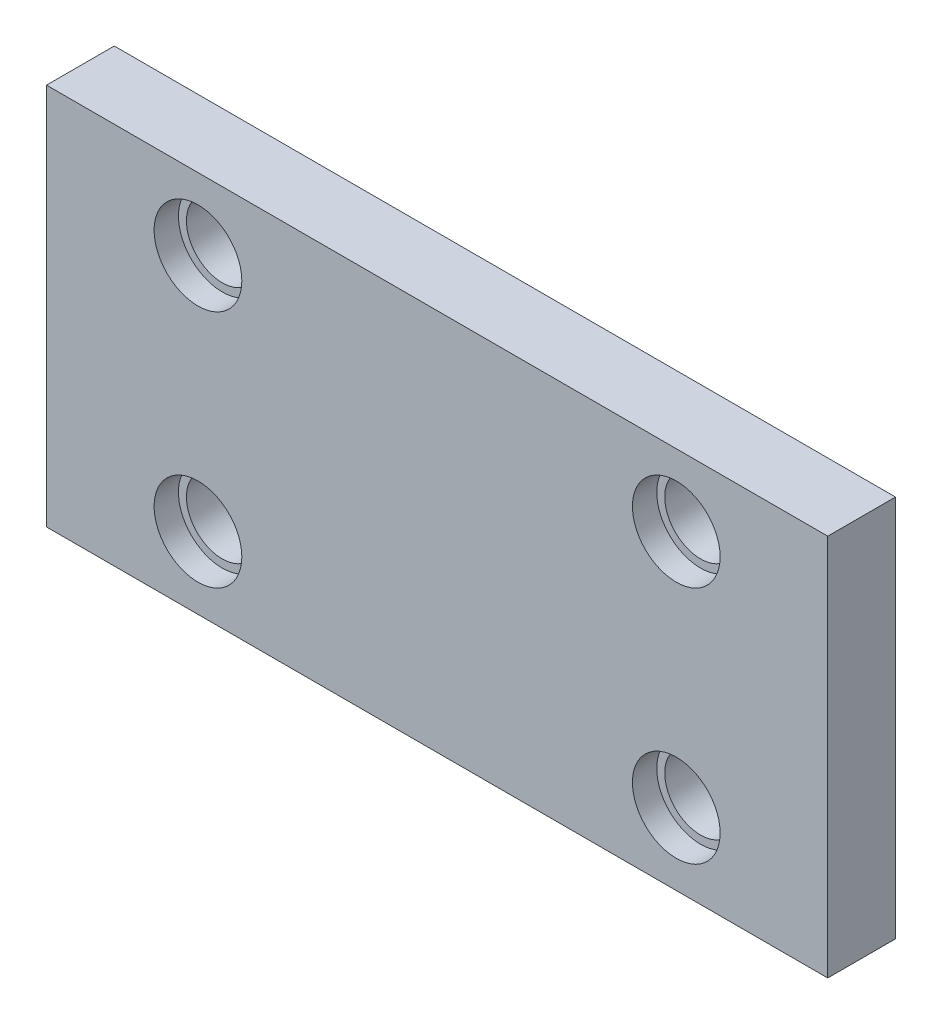
ISO-10303-21;
HEADER;
FILE_DESCRIPTION(('STEP AP214'),'2;1');
FILE_NAME('part.step','',(''),(''),'','','');
FILE_SCHEMA(('AUTOMOTIVE_DESIGN { 1 0 10303 214 1 1 1 1 }'));
ENDSEC;
DATA;
#1=APPLICATION_CONTEXT('core data for automotive mechanical design processes');
#2=APPLICATION_PROTOCOL_DEFINITION('international standard','automotive_design',2000,#1);
#3=PRODUCT_CONTEXT('',#1,'mechanical');
#4=PRODUCT('Part','Part','',(#3));
#5=PRODUCT_RELATED_PRODUCT_CATEGORY('part','',(#4));
#6=PRODUCT_DEFINITION_FORMATION('','',#4);
#7=PRODUCT_DEFINITION_CONTEXT('part definition',#1,'design');
#8=PRODUCT_DEFINITION('design','',#6,#7);
#9=PRODUCT_DEFINITION_SHAPE('','',#8);
#10=(LENGTH_UNIT() NAMED_UNIT(*) SI_UNIT(.MILLI.,.METRE.));
#11=(NAMED_UNIT(*) PLANE_ANGLE_UNIT() SI_UNIT($,.RADIAN.));
#12=(NAMED_UNIT(*) SI_UNIT($,.STERADIAN.) SOLID_ANGLE_UNIT());
#13=UNCERTAINTY_MEASURE_WITH_UNIT(LENGTH_MEASURE(1.E-05),#10,'distance_accuracy_value','');
#14=(GEOMETRIC_REPRESENTATION_CONTEXT(3) GLOBAL_UNCERTAINTY_ASSIGNED_CONTEXT((#13)) GLOBAL_UNIT_ASSIGNED_CONTEXT((#10,
#11,#12)) REPRESENTATION_CONTEXT('',''));
#15=CARTESIAN_POINT('',(0.,0.,0.));
#16=DIRECTION('',(0.,0.,1.));
#17=DIRECTION('',(1.,0.,0.));
#18=AXIS2_PLACEMENT_3D('',#15,#16,#17);
#19=CARTESIAN_POINT('',(-98.,-48.,-17.));
#20=DIRECTION('',(-1.,0.,0.));
#21=DIRECTION('',(0.,-1.,0.));
#22=AXIS2_PLACEMENT_3D('',#19,#20,#21);
#23=PLANE('',#22);
#24=DIRECTION('',(0.,-1.,0.));
#25=VECTOR('',#24,1.);
#26=CARTESIAN_POINT('',(-98.,-48.,0.));
#27=LINE('',#26,#25);
#28=CARTESIAN_POINT('',(-98.,48.,0.));
#29=VERTEX_POINT('',#28);
#30=CARTESIAN_POINT('',(-98.,-48.,0.));
#31=VERTEX_POINT('',#30);
#32=EDGE_CURVE('E100',#29,#31,#27,.T.);
#33=ORIENTED_EDGE('',*,*,#32,.F.);
#34=DIRECTION('',(0.,0.,1.));
#35=VECTOR('',#34,1.);
#36=CARTESIAN_POINT('',(-98.,48.,-17.));
#37=LINE('',#36,#35);
#38=CARTESIAN_POINT('',(-98.,48.,-17.));
#39=VERTEX_POINT('',#38);
#40=EDGE_CURVE('E11',#39,#29,#37,.T.);
#41=ORIENTED_EDGE('',*,*,#40,.F.);
#42=DIRECTION('',(0.,-1.,0.));
#43=VECTOR('',#42,1.);
#44=CARTESIAN_POINT('',(-98.,-48.,-17.));
#45=LINE('',#44,#43);
#46=CARTESIAN_POINT('',(-98.,-48.,-17.));
#47=VERTEX_POINT('',#46);
#48=EDGE_CURVE('E93',#39,#47,#45,.T.);
#49=ORIENTED_EDGE('',*,*,#48,.T.);
#50=DIRECTION('',(0.,0.,1.));
#51=VECTOR('',#50,1.);
#52=CARTESIAN_POINT('',(-98.,-48.,-17.));
#53=LINE('',#52,#51);
#54=EDGE_CURVE('E38',#47,#31,#53,.T.);
#55=ORIENTED_EDGE('',*,*,#54,.T.);
#56=EDGE_LOOP('',(#33,#41,#49,#55));
#57=FACE_BOUND('',#56,.T.);
#58=ADVANCED_FACE('F35',(#57),#23,.T.);
#59=CARTESIAN_POINT('',(97.9999999999999,48.,-17.));
#60=DIRECTION('',(0.,1.,0.));
#61=DIRECTION('',(-1.,0.,0.));
#62=AXIS2_PLACEMENT_3D('',#59,#60,#61);
#63=PLANE('',#62);
#64=DIRECTION('',(-1.,0.,0.));
#65=VECTOR('',#64,1.);
#66=CARTESIAN_POINT('',(97.9999999999999,48.,0.));
#67=LINE('',#66,#65);
#68=CARTESIAN_POINT('',(97.9999999999999,48.,0.));
#69=VERTEX_POINT('',#68);
#70=EDGE_CURVE('E95',#69,#29,#67,.T.);
#71=ORIENTED_EDGE('',*,*,#70,.F.);
#72=DIRECTION('',(0.,0.,1.));
#73=VECTOR('',#72,1.);
#74=CARTESIAN_POINT('',(97.9999999999999,48.,-17.));
#75=LINE('',#74,#73);
#76=CARTESIAN_POINT('',(97.9999999999999,48.,-17.));
#77=VERTEX_POINT('',#76);
#78=EDGE_CURVE('E44',#77,#69,#75,.T.);
#79=ORIENTED_EDGE('',*,*,#78,.F.);
#80=DIRECTION('',(-1.,0.,0.));
#81=VECTOR('',#80,1.);
#82=CARTESIAN_POINT('',(97.9999999999999,48.,-17.));
#83=LINE('',#82,#81);
#84=EDGE_CURVE('E90',#77,#39,#83,.T.);
#85=ORIENTED_EDGE('',*,*,#84,.T.);
#86=ORIENTED_EDGE('',*,*,#40,.T.);
#87=EDGE_LOOP('',(#71,#79,#85,#86));
#88=FACE_BOUND('',#87,.T.);
#89=ADVANCED_FACE('F111',(#88),#63,.T.);
#90=CARTESIAN_POINT('',(97.9999999999999,-48.,-17.));
#91=DIRECTION('',(1.,0.,0.));
#92=DIRECTION('',(0.,0.,-1.));
#93=AXIS2_PLACEMENT_3D('',#90,#91,#92);
#94=PLANE('',#93);
#95=DIRECTION('',(0.,1.,0.));
#96=VECTOR('',#95,1.);
#97=CARTESIAN_POINT('',(97.9999999999999,-48.,0.));
#98=LINE('',#97,#96);
#99=CARTESIAN_POINT('',(97.9999999999999,-48.,0.));
#100=VERTEX_POINT('',#99);
#101=EDGE_CURVE('E85',#100,#69,#98,.T.);
#102=ORIENTED_EDGE('',*,*,#101,.F.);
#103=DIRECTION('',(0.,0.,1.));
#104=VECTOR('',#103,1.);
#105=CARTESIAN_POINT('',(97.9999999999999,-48.,-17.));
#106=LINE('',#105,#104);
#107=CARTESIAN_POINT('',(97.9999999999999,-48.,-17.));
#108=VERTEX_POINT('',#107);
#109=EDGE_CURVE('E80',#108,#100,#106,.T.);
#110=ORIENTED_EDGE('',*,*,#109,.F.);
#111=DIRECTION('',(0.,1.,0.));
#112=VECTOR('',#111,1.);
#113=CARTESIAN_POINT('',(97.9999999999999,-48.,-17.));
#114=LINE('',#113,#112);
#115=EDGE_CURVE('E83',#108,#77,#114,.T.);
#116=ORIENTED_EDGE('',*,*,#115,.T.);
#117=ORIENTED_EDGE('',*,*,#78,.T.);
#118=EDGE_LOOP('',(#102,#110,#116,#117));
#119=FACE_BOUND('',#118,.T.);
#120=ADVANCED_FACE('F82',(#119),#94,.T.);
#121=CARTESIAN_POINT('',(97.9999999999999,-48.,-17.));
#122=DIRECTION('',(0.,-1.,0.));
#123=DIRECTION('',(1.,0.,0.));
#124=AXIS2_PLACEMENT_3D('',#121,#122,#123);
#125=PLANE('',#124);
#126=DIRECTION('',(1.,0.,0.));
#127=VECTOR('',#126,1.);
#128=CARTESIAN_POINT('',(97.9999999999999,-48.,0.));
#129=LINE('',#128,#127);
#130=EDGE_CURVE('E103',#31,#100,#129,.T.);
#131=ORIENTED_EDGE('',*,*,#130,.F.);
#132=ORIENTED_EDGE('',*,*,#54,.F.);
#133=DIRECTION('',(1.,0.,0.));
#134=VECTOR('',#133,1.);
#135=CARTESIAN_POINT('',(97.9999999999999,-48.,-17.));
#136=LINE('',#135,#134);
#137=EDGE_CURVE('E89',#47,#108,#136,.T.);
#138=ORIENTED_EDGE('',*,*,#137,.T.);
#139=ORIENTED_EDGE('',*,*,#109,.T.);
#140=EDGE_LOOP('',(#131,#132,#138,#139));
#141=FACE_BOUND('',#140,.T.);
#142=ADVANCED_FACE('F92',(#141),#125,.T.);
#143=CARTESIAN_POINT('',(-98.0000000000001,48.,-17.));
#144=DIRECTION('',(0.,0.,1.));
#145=DIRECTION('',(1.,0.,0.));
#146=AXIS2_PLACEMENT_3D('',#143,#144,#145);
#147=PLANE('',#146);
#148=CARTESIAN_POINT('',(60.,30.,-17.));
#149=DIRECTION('',(0.,0.,1.));
#150=DIRECTION('',(1.,0.,0.));
#151=AXIS2_PLACEMENT_3D('',#148,#149,#150);
#152=CIRCLE('',#151,8.99999999999999);
#153=CARTESIAN_POINT('',(69.,30.,-17.));
#154=VERTEX_POINT('',#153);
#155=EDGE_CURVE('E195',#154,#154,#152,.T.);
#156=ORIENTED_EDGE('',*,*,#155,.T.);
#157=EDGE_LOOP('',(#156));
#158=FACE_BOUND('',#157,.T.);
#159=CARTESIAN_POINT('',(-60.,30.,-17.));
#160=DIRECTION('',(0.,0.,1.));
#161=DIRECTION('',(1.,0.,0.));
#162=AXIS2_PLACEMENT_3D('',#159,#160,#161);
#163=CIRCLE('',#162,8.99999999999999);
#164=CARTESIAN_POINT('',(-51.,30.,-17.));
#165=VERTEX_POINT('',#164);
#166=EDGE_CURVE('E206',#165,#165,#163,.T.);
#167=ORIENTED_EDGE('',*,*,#166,.T.);
#168=EDGE_LOOP('',(#167));
#169=FACE_BOUND('',#168,.T.);
#170=CARTESIAN_POINT('',(-60.,-30.,-17.));
#171=DIRECTION('',(0.,0.,1.));
#172=DIRECTION('',(1.,0.,0.));
#173=AXIS2_PLACEMENT_3D('',#170,#171,#172);
#174=CIRCLE('',#173,8.99999999999999);
#175=CARTESIAN_POINT('',(-51.,-30.,-17.));
#176=VERTEX_POINT('',#175);
#177=EDGE_CURVE('E218',#176,#176,#174,.T.);
#178=ORIENTED_EDGE('',*,*,#177,.T.);
#179=EDGE_LOOP('',(#178));
#180=FACE_BOUND('',#179,.T.);
#181=CARTESIAN_POINT('',(60.,-30.,-17.));
#182=DIRECTION('',(0.,0.,1.));
#183=DIRECTION('',(1.,0.,0.));
#184=AXIS2_PLACEMENT_3D('',#181,#182,#183);
#185=CIRCLE('',#184,8.99999999999999);
#186=CARTESIAN_POINT('',(69.,-30.,-17.));
#187=VERTEX_POINT('',#186);
#188=EDGE_CURVE('E104',#187,#187,#185,.T.);
#189=ORIENTED_EDGE('',*,*,#188,.T.);
#190=EDGE_LOOP('',(#189));
#191=FACE_BOUND('',#190,.T.);
#192=ORIENTED_EDGE('',*,*,#48,.F.);
#193=ORIENTED_EDGE('',*,*,#84,.F.);
#194=ORIENTED_EDGE('',*,*,#115,.F.);
#195=ORIENTED_EDGE('',*,*,#137,.F.);
#196=EDGE_LOOP('',(#192,#193,#194,#195));
#197=FACE_BOUND('',#196,.T.);
#198=ADVANCED_FACE('F88',(#158,#169,#180,#191,#197),#147,.F.);
#199=CARTESIAN_POINT('',(-98.0000000000001,48.,0.));
#200=DIRECTION('',(0.,0.,1.));
#201=DIRECTION('',(1.,0.,0.));
#202=AXIS2_PLACEMENT_3D('',#199,#200,#201);
#203=PLANE('',#202);
#204=CARTESIAN_POINT('',(60.,30.,0.));
#205=DIRECTION('',(0.,0.,1.));
#206=DIRECTION('',(1.,0.,0.));
#207=AXIS2_PLACEMENT_3D('',#204,#205,#206);
#208=CIRCLE('',#207,11.);
#209=CARTESIAN_POINT('',(71.,30.,0.));
#210=VERTEX_POINT('',#209);
#211=EDGE_CURVE('E188',#210,#210,#208,.T.);
#212=ORIENTED_EDGE('',*,*,#211,.F.);
#213=EDGE_LOOP('',(#212));
#214=FACE_BOUND('',#213,.T.);
#215=CARTESIAN_POINT('',(-60.,30.,0.));
#216=DIRECTION('',(0.,0.,1.));
#217=DIRECTION('',(1.,0.,0.));
#218=AXIS2_PLACEMENT_3D('',#215,#216,#217);
#219=CIRCLE('',#218,11.);
#220=CARTESIAN_POINT('',(-49.,30.,0.));
#221=VERTEX_POINT('',#220);
#222=EDGE_CURVE('E197',#221,#221,#219,.T.);
#223=ORIENTED_EDGE('',*,*,#222,.F.);
#224=EDGE_LOOP('',(#223));
#225=FACE_BOUND('',#224,.T.);
#226=CARTESIAN_POINT('',(-60.,-30.,0.));
#227=DIRECTION('',(0.,0.,1.));
#228=DIRECTION('',(1.,0.,0.));
#229=AXIS2_PLACEMENT_3D('',#226,#227,#228);
#230=CIRCLE('',#229,11.);
#231=CARTESIAN_POINT('',(-49.,-30.,0.));
#232=VERTEX_POINT('',#231);
#233=EDGE_CURVE('E209',#232,#232,#230,.T.);
#234=ORIENTED_EDGE('',*,*,#233,.F.);
#235=EDGE_LOOP('',(#234));
#236=FACE_BOUND('',#235,.T.);
#237=CARTESIAN_POINT('',(60.,-30.,0.));
#238=DIRECTION('',(0.,0.,1.));
#239=DIRECTION('',(1.,0.,0.));
#240=AXIS2_PLACEMENT_3D('',#237,#238,#239);
#241=CIRCLE('',#240,11.);
#242=CARTESIAN_POINT('',(71.,-30.,0.));
#243=VERTEX_POINT('',#242);
#244=EDGE_CURVE('E221',#243,#243,#241,.T.);
#245=ORIENTED_EDGE('',*,*,#244,.F.);
#246=EDGE_LOOP('',(#245));
#247=FACE_BOUND('',#246,.T.);
#248=ORIENTED_EDGE('',*,*,#32,.T.);
#249=ORIENTED_EDGE('',*,*,#130,.T.);
#250=ORIENTED_EDGE('',*,*,#101,.T.);
#251=ORIENTED_EDGE('',*,*,#70,.T.);
#252=EDGE_LOOP('',(#248,#249,#250,#251));
#253=FACE_BOUND('',#252,.T.);
#254=ADVANCED_FACE('F110',(#214,#225,#236,#247,#253),#203,.T.);
#255=CARTESIAN_POINT('',(60.,-30.,0.));
#256=DIRECTION('',(0.,0.,1.));
#257=DIRECTION('',(1.,0.,0.));
#258=AXIS2_PLACEMENT_3D('',#255,#256,#257);
#259=CYLINDRICAL_SURFACE('',#258,8.99999999999999);
#260=ORIENTED_EDGE('',*,*,#188,.F.);
#261=EDGE_LOOP('',(#260));
#262=FACE_BOUND('',#261,.T.);
#263=CARTESIAN_POINT('',(60.,-30.,-6.1));
#264=DIRECTION('',(0.,0.,1.));
#265=DIRECTION('',(1.,0.,0.));
#266=AXIS2_PLACEMENT_3D('',#263,#264,#265);
#267=CIRCLE('',#266,8.99999999999999);
#268=CARTESIAN_POINT('',(69.,-30.,-6.1));
#269=VERTEX_POINT('',#268);
#270=EDGE_CURVE('E227',#269,#269,#267,.T.);
#271=ORIENTED_EDGE('',*,*,#270,.T.);
#272=EDGE_LOOP('',(#271));
#273=FACE_BOUND('',#272,.T.);
#274=ADVANCED_FACE('F129',(#262,#273),#259,.F.);
#275=CARTESIAN_POINT('',(69.,-30.,-6.1));
#276=DIRECTION('',(0.,0.,-1.));
#277=DIRECTION('',(-1.,0.,0.));
#278=AXIS2_PLACEMENT_3D('',#275,#276,#277);
#279=PLANE('',#278);
#280=ORIENTED_EDGE('',*,*,#270,.F.);
#281=EDGE_LOOP('',(#280));
#282=FACE_BOUND('',#281,.T.);
#283=CARTESIAN_POINT('',(60.,-30.,-6.1));
#284=DIRECTION('',(0.,0.,1.));
#285=DIRECTION('',(1.,0.,0.));
#286=AXIS2_PLACEMENT_3D('',#283,#284,#285);
#287=CIRCLE('',#286,11.);
#288=CARTESIAN_POINT('',(71.,-30.,-6.1));
#289=VERTEX_POINT('',#288);
#290=EDGE_CURVE('E224',#289,#289,#287,.T.);
#291=ORIENTED_EDGE('',*,*,#290,.T.);
#292=EDGE_LOOP('',(#291));
#293=FACE_BOUND('',#292,.T.);
#294=ADVANCED_FACE('F136',(#282,#293),#279,.F.);
#295=CARTESIAN_POINT('',(60.,-30.,0.));
#296=DIRECTION('',(0.,0.,1.));
#297=DIRECTION('',(1.,0.,0.));
#298=AXIS2_PLACEMENT_3D('',#295,#296,#297);
#299=CYLINDRICAL_SURFACE('',#298,11.);
#300=ORIENTED_EDGE('',*,*,#290,.F.);
#301=EDGE_LOOP('',(#300));
#302=FACE_BOUND('',#301,.T.);
#303=ORIENTED_EDGE('',*,*,#244,.T.);
#304=EDGE_LOOP('',(#303));
#305=FACE_BOUND('',#304,.T.);
#306=ADVANCED_FACE('F140',(#302,#305),#299,.F.);
#307=CARTESIAN_POINT('',(-60.,-30.,0.));
#308=DIRECTION('',(0.,0.,1.));
#309=DIRECTION('',(1.,0.,0.));
#310=AXIS2_PLACEMENT_3D('',#307,#308,#309);
#311=CYLINDRICAL_SURFACE('',#310,8.99999999999999);
#312=ORIENTED_EDGE('',*,*,#177,.F.);
#313=EDGE_LOOP('',(#312));
#314=FACE_BOUND('',#313,.T.);
#315=CARTESIAN_POINT('',(-60.,-30.,-6.1));
#316=DIRECTION('',(0.,0.,1.));
#317=DIRECTION('',(1.,0.,0.));
#318=AXIS2_PLACEMENT_3D('',#315,#316,#317);
#319=CIRCLE('',#318,8.99999999999999);
#320=CARTESIAN_POINT('',(-51.,-30.,-6.1));
#321=VERTEX_POINT('',#320);
#322=EDGE_CURVE('E215',#321,#321,#319,.T.);
#323=ORIENTED_EDGE('',*,*,#322,.T.);
#324=EDGE_LOOP('',(#323));
#325=FACE_BOUND('',#324,.T.);
#326=ADVANCED_FACE('F144',(#314,#325),#311,.F.);
#327=CARTESIAN_POINT('',(-51.,-30.,-6.1));
#328=DIRECTION('',(0.,0.,-1.));
#329=DIRECTION('',(-1.,0.,0.));
#330=AXIS2_PLACEMENT_3D('',#327,#328,#329);
#331=PLANE('',#330);
#332=ORIENTED_EDGE('',*,*,#322,.F.);
#333=EDGE_LOOP('',(#332));
#334=FACE_BOUND('',#333,.T.);
#335=CARTESIAN_POINT('',(-60.,-30.,-6.1));
#336=DIRECTION('',(0.,0.,1.));
#337=DIRECTION('',(1.,0.,0.));
#338=AXIS2_PLACEMENT_3D('',#335,#336,#337);
#339=CIRCLE('',#338,11.);
#340=CARTESIAN_POINT('',(-49.,-30.,-6.1));
#341=VERTEX_POINT('',#340);
#342=EDGE_CURVE('E212',#341,#341,#339,.T.);
#343=ORIENTED_EDGE('',*,*,#342,.T.);
#344=EDGE_LOOP('',(#343));
#345=FACE_BOUND('',#344,.T.);
#346=ADVANCED_FACE('F148',(#334,#345),#331,.F.);
#347=CARTESIAN_POINT('',(-60.,-30.,0.));
#348=DIRECTION('',(0.,0.,1.));
#349=DIRECTION('',(1.,0.,0.));
#350=AXIS2_PLACEMENT_3D('',#347,#348,#349);
#351=CYLINDRICAL_SURFACE('',#350,11.);
#352=ORIENTED_EDGE('',*,*,#342,.F.);
#353=EDGE_LOOP('',(#352));
#354=FACE_BOUND('',#353,.T.);
#355=ORIENTED_EDGE('',*,*,#233,.T.);
#356=EDGE_LOOP('',(#355));
#357=FACE_BOUND('',#356,.T.);
#358=ADVANCED_FACE('F152',(#354,#357),#351,.F.);
#359=CARTESIAN_POINT('',(-60.,30.,0.));
#360=DIRECTION('',(0.,0.,1.));
#361=DIRECTION('',(1.,0.,0.));
#362=AXIS2_PLACEMENT_3D('',#359,#360,#361);
#363=CYLINDRICAL_SURFACE('',#362,8.99999999999999);
#364=ORIENTED_EDGE('',*,*,#166,.F.);
#365=EDGE_LOOP('',(#364));
#366=FACE_BOUND('',#365,.T.);
#367=CARTESIAN_POINT('',(-60.,30.,-6.1));
#368=DIRECTION('',(0.,0.,1.));
#369=DIRECTION('',(1.,0.,0.));
#370=AXIS2_PLACEMENT_3D('',#367,#368,#369);
#371=CIRCLE('',#370,8.99999999999999);
#372=CARTESIAN_POINT('',(-51.,30.,-6.1));
#373=VERTEX_POINT('',#372);
#374=EDGE_CURVE('E203',#373,#373,#371,.T.);
#375=ORIENTED_EDGE('',*,*,#374,.T.);
#376=EDGE_LOOP('',(#375));
#377=FACE_BOUND('',#376,.T.);
#378=ADVANCED_FACE('F156',(#366,#377),#363,.F.);
#379=CARTESIAN_POINT('',(-51.,30.,-6.1));
#380=DIRECTION('',(0.,0.,-1.));
#381=DIRECTION('',(-1.,0.,0.));
#382=AXIS2_PLACEMENT_3D('',#379,#380,#381);
#383=PLANE('',#382);
#384=ORIENTED_EDGE('',*,*,#374,.F.);
#385=EDGE_LOOP('',(#384));
#386=FACE_BOUND('',#385,.T.);
#387=CARTESIAN_POINT('',(-60.,30.,-6.1));
#388=DIRECTION('',(0.,0.,1.));
#389=DIRECTION('',(1.,0.,0.));
#390=AXIS2_PLACEMENT_3D('',#387,#388,#389);
#391=CIRCLE('',#390,11.);
#392=CARTESIAN_POINT('',(-49.,30.,-6.1));
#393=VERTEX_POINT('',#392);
#394=EDGE_CURVE('E200',#393,#393,#391,.T.);
#395=ORIENTED_EDGE('',*,*,#394,.T.);
#396=EDGE_LOOP('',(#395));
#397=FACE_BOUND('',#396,.T.);
#398=ADVANCED_FACE('F160',(#386,#397),#383,.F.);
#399=CARTESIAN_POINT('',(-60.,30.,0.));
#400=DIRECTION('',(0.,0.,1.));
#401=DIRECTION('',(1.,0.,0.));
#402=AXIS2_PLACEMENT_3D('',#399,#400,#401);
#403=CYLINDRICAL_SURFACE('',#402,11.);
#404=ORIENTED_EDGE('',*,*,#394,.F.);
#405=EDGE_LOOP('',(#404));
#406=FACE_BOUND('',#405,.T.);
#407=ORIENTED_EDGE('',*,*,#222,.T.);
#408=EDGE_LOOP('',(#407));
#409=FACE_BOUND('',#408,.T.);
#410=ADVANCED_FACE('F164',(#406,#409),#403,.F.);
#411=CARTESIAN_POINT('',(60.,30.,0.));
#412=DIRECTION('',(0.,0.,1.));
#413=DIRECTION('',(1.,0.,0.));
#414=AXIS2_PLACEMENT_3D('',#411,#412,#413);
#415=CYLINDRICAL_SURFACE('',#414,8.99999999999999);
#416=ORIENTED_EDGE('',*,*,#155,.F.);
#417=EDGE_LOOP('',(#416));
#418=FACE_BOUND('',#417,.T.);
#419=CARTESIAN_POINT('',(60.,30.,-6.1));
#420=DIRECTION('',(0.,0.,1.));
#421=DIRECTION('',(1.,0.,0.));
#422=AXIS2_PLACEMENT_3D('',#419,#420,#421);
#423=CIRCLE('',#422,8.99999999999999);
#424=CARTESIAN_POINT('',(69.,30.,-6.1));
#425=VERTEX_POINT('',#424);
#426=EDGE_CURVE('E190',#425,#425,#423,.T.);
#427=ORIENTED_EDGE('',*,*,#426,.T.);
#428=EDGE_LOOP('',(#427));
#429=FACE_BOUND('',#428,.T.);
#430=ADVANCED_FACE('F168',(#418,#429),#415,.F.);
#431=CARTESIAN_POINT('',(69.,30.,-6.1));
#432=DIRECTION('',(0.,0.,-1.));
#433=DIRECTION('',(-1.,0.,0.));
#434=AXIS2_PLACEMENT_3D('',#431,#432,#433);
#435=PLANE('',#434);
#436=ORIENTED_EDGE('',*,*,#426,.F.);
#437=EDGE_LOOP('',(#436));
#438=FACE_BOUND('',#437,.T.);
#439=CARTESIAN_POINT('',(60.,30.,-6.1));
#440=DIRECTION('',(0.,0.,1.));
#441=DIRECTION('',(1.,0.,0.));
#442=AXIS2_PLACEMENT_3D('',#439,#440,#441);
#443=CIRCLE('',#442,11.);
#444=CARTESIAN_POINT('',(71.,30.,-6.1));
#445=VERTEX_POINT('',#444);
#446=EDGE_CURVE('E185',#445,#445,#443,.T.);
#447=ORIENTED_EDGE('',*,*,#446,.T.);
#448=EDGE_LOOP('',(#447));
#449=FACE_BOUND('',#448,.T.);
#450=ADVANCED_FACE('F172',(#438,#449),#435,.F.);
#451=CARTESIAN_POINT('',(60.,30.,0.));
#452=DIRECTION('',(0.,0.,1.));
#453=DIRECTION('',(1.,0.,0.));
#454=AXIS2_PLACEMENT_3D('',#451,#452,#453);
#455=CYLINDRICAL_SURFACE('',#454,11.);
#456=ORIENTED_EDGE('',*,*,#446,.F.);
#457=EDGE_LOOP('',(#456));
#458=FACE_BOUND('',#457,.T.);
#459=ORIENTED_EDGE('',*,*,#211,.T.);
#460=EDGE_LOOP('',(#459));
#461=FACE_BOUND('',#460,.T.);
#462=ADVANCED_FACE('F176',(#458,#461),#455,.F.);
#463=CLOSED_SHELL('',(#58,#89,#120,#142,#198,#254,#274,#294,#306,#326,#346,#358,#378,#398,#410,
#430,#450,#462));
#464=MANIFOLD_SOLID_BREP('B2',#463);
#465=ADVANCED_BREP_SHAPE_REPRESENTATION('',(#18,#464),#14);
#466=SHAPE_DEFINITION_REPRESENTATION(#9,#465);
ENDSEC;
END-ISO-10303-21;
